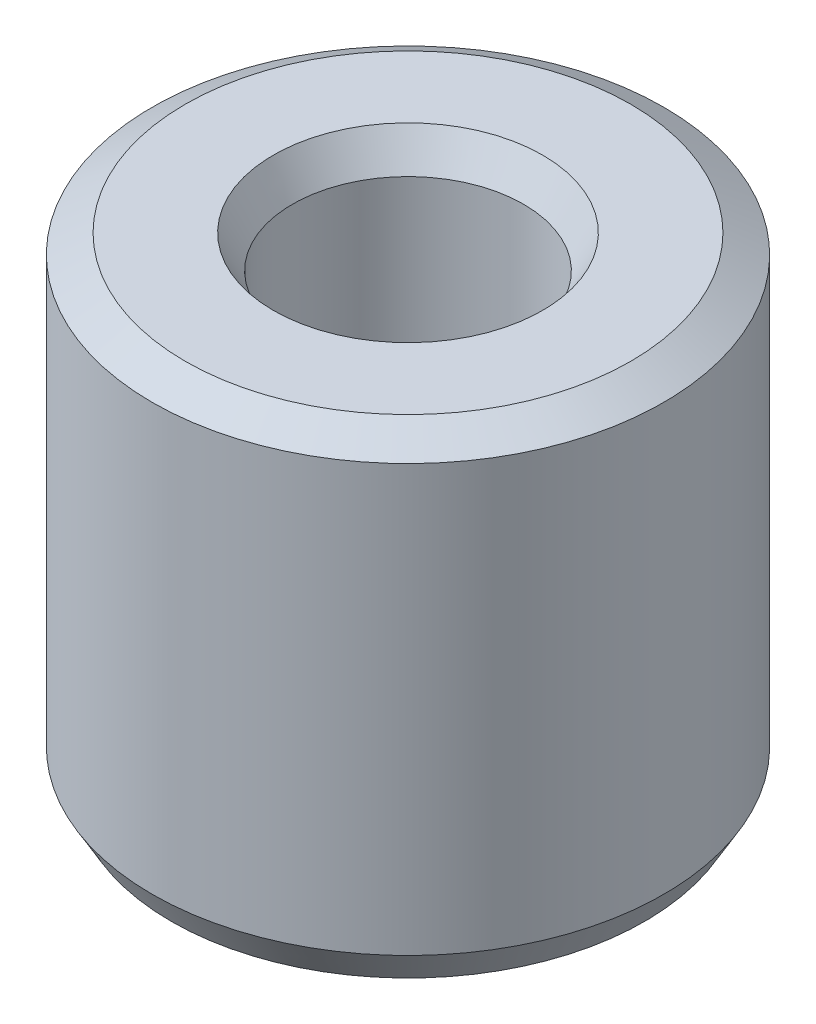
ISO-10303-21;
HEADER;
FILE_DESCRIPTION(('STEP AP214'),'2;1');
FILE_NAME('part.step','',(''),(''),'','','');
FILE_SCHEMA(('AUTOMOTIVE_DESIGN { 1 0 10303 214 1 1 1 1 }'));
ENDSEC;
DATA;
#1=APPLICATION_CONTEXT('core data for automotive mechanical design processes');
#2=APPLICATION_PROTOCOL_DEFINITION('international standard','automotive_design',2000,#1);
#3=PRODUCT_CONTEXT('',#1,'mechanical');
#4=PRODUCT('Part','Part','',(#3));
#5=PRODUCT_RELATED_PRODUCT_CATEGORY('part','',(#4));
#6=PRODUCT_DEFINITION_FORMATION('','',#4);
#7=PRODUCT_DEFINITION_CONTEXT('part definition',#1,'design');
#8=PRODUCT_DEFINITION('design','',#6,#7);
#9=PRODUCT_DEFINITION_SHAPE('','',#8);
#10=(LENGTH_UNIT() NAMED_UNIT(*) SI_UNIT(.MILLI.,.METRE.));
#11=(NAMED_UNIT(*) PLANE_ANGLE_UNIT() SI_UNIT($,.RADIAN.));
#12=(NAMED_UNIT(*) SI_UNIT($,.STERADIAN.) SOLID_ANGLE_UNIT());
#13=UNCERTAINTY_MEASURE_WITH_UNIT(LENGTH_MEASURE(1.E-05),#10,'distance_accuracy_value','');
#14=(GEOMETRIC_REPRESENTATION_CONTEXT(3) GLOBAL_UNCERTAINTY_ASSIGNED_CONTEXT((#13)) GLOBAL_UNIT_ASSIGNED_CONTEXT((#10,
#11,#12)) REPRESENTATION_CONTEXT('',''));
#15=CARTESIAN_POINT('',(0.,0.,0.));
#16=DIRECTION('',(0.,0.,1.));
#17=DIRECTION('',(1.,0.,0.));
#18=AXIS2_PLACEMENT_3D('',#15,#16,#17);
#19=CARTESIAN_POINT('',(0.,9.34786560931737,0.));
#20=DIRECTION('',(0.,-1.,0.));
#21=DIRECTION('',(0.,0.,-1.));
#22=AXIS2_PLACEMENT_3D('',#19,#20,#21);
#23=CYLINDRICAL_SURFACE('',#22,5.);
#24=CARTESIAN_POINT('',(0.,0.64557947320755,0.));
#25=DIRECTION('',(0.,1.,0.));
#26=DIRECTION('',(0.,0.,1.));
#27=AXIS2_PLACEMENT_3D('',#24,#25,#26);
#28=CIRCLE('',#27,5.);
#29=CARTESIAN_POINT('',(0.,0.64557947320755,5.));
#30=VERTEX_POINT('',#29);
#31=EDGE_CURVE('E10',#30,#30,#28,.T.);
#32=ORIENTED_EDGE('',*,*,#31,.T.);
#33=EDGE_LOOP('',(#32));
#34=FACE_BOUND('',#33,.T.);
#35=CARTESIAN_POINT('',(0.,8.97514012667769,0.));
#36=DIRECTION('',(0.,1.,0.));
#37=DIRECTION('',(0.,0.,1.));
#38=AXIS2_PLACEMENT_3D('',#35,#36,#37);
#39=CIRCLE('',#38,5.);
#40=CARTESIAN_POINT('',(0.,8.97514012667769,5.));
#41=VERTEX_POINT('',#40);
#42=EDGE_CURVE('E50',#41,#41,#39,.F.);
#43=ORIENTED_EDGE('',*,*,#42,.T.);
#44=EDGE_LOOP('',(#43));
#45=FACE_BOUND('',#44,.T.);
#46=ADVANCED_FACE('F39',(#34,#45),#23,.T.);
#47=CARTESIAN_POINT('',(0.,9.34786560931737,0.));
#48=DIRECTION('',(0.,1.,0.));
#49=DIRECTION('',(0.,0.,1.));
#50=AXIS2_PLACEMENT_3D('',#47,#48,#49);
#51=PLANE('',#50);
#52=CARTESIAN_POINT('',(0.,9.34786560931737,0.));
#53=DIRECTION('',(0.,1.,0.));
#54=DIRECTION('',(0.,0.,1.));
#55=AXIS2_PLACEMENT_3D('',#52,#53,#54);
#56=CIRCLE('',#55,2.63191980888608);
#57=CARTESIAN_POINT('',(0.,9.34786560931737,2.63191980888608));
#58=VERTEX_POINT('',#57);
#59=EDGE_CURVE('E58',#58,#58,#56,.F.);
#60=ORIENTED_EDGE('',*,*,#59,.T.);
#61=EDGE_LOOP('',(#60));
#62=FACE_BOUND('',#61,.T.);
#63=CARTESIAN_POINT('',(0.,9.34786560931737,0.));
#64=DIRECTION('',(0.,1.,0.));
#65=DIRECTION('',(0.,0.,1.));
#66=AXIS2_PLACEMENT_3D('',#63,#64,#65);
#67=CIRCLE('',#66,4.35442052679245);
#68=CARTESIAN_POINT('',(0.,9.34786560931737,4.35442052679245));
#69=VERTEX_POINT('',#68);
#70=EDGE_CURVE('E61',#69,#69,#67,.T.);
#71=ORIENTED_EDGE('',*,*,#70,.T.);
#72=EDGE_LOOP('',(#71));
#73=FACE_BOUND('',#72,.T.);
#74=ADVANCED_FACE('F88',(#62,#73),#51,.T.);
#75=CARTESIAN_POINT('',(0.,0.,0.));
#76=DIRECTION('',(0.,1.,0.));
#77=DIRECTION('',(0.,0.,1.));
#78=AXIS2_PLACEMENT_3D('',#75,#76,#77);
#79=PLANE('',#78);
#80=CARTESIAN_POINT('',(0.,0.,0.));
#81=DIRECTION('',(0.,1.,0.));
#82=DIRECTION('',(0.,0.,1.));
#83=AXIS2_PLACEMENT_3D('',#80,#81,#82);
#84=CIRCLE('',#83,2.90477379945395);
#85=CARTESIAN_POINT('',(0.,0.,2.90477379945395));
#86=VERTEX_POINT('',#85);
#87=EDGE_CURVE('E51',#86,#86,#84,.T.);
#88=ORIENTED_EDGE('',*,*,#87,.T.);
#89=EDGE_LOOP('',(#88));
#90=FACE_BOUND('',#89,.T.);
#91=CARTESIAN_POINT('',(0.,0.,0.));
#92=DIRECTION('',(0.,1.,0.));
#93=DIRECTION('',(0.,0.,1.));
#94=AXIS2_PLACEMENT_3D('',#91,#92,#93);
#95=CIRCLE('',#94,4.62727451736032);
#96=CARTESIAN_POINT('',(0.,0.,4.62727451736032));
#97=VERTEX_POINT('',#96);
#98=EDGE_CURVE('E54',#97,#97,#95,.F.);
#99=ORIENTED_EDGE('',*,*,#98,.T.);
#100=EDGE_LOOP('',(#99));
#101=FACE_BOUND('',#100,.T.);
#102=ADVANCED_FACE('F83',(#90,#101),#79,.F.);
#103=CARTESIAN_POINT('',(0.,9.34786560931737,0.));
#104=DIRECTION('',(0.,-1.,0.));
#105=DIRECTION('',(0.,0.,-1.));
#106=AXIS2_PLACEMENT_3D('',#103,#104,#105);
#107=CYLINDRICAL_SURFACE('',#106,2.2591943262464);
#108=CARTESIAN_POINT('',(0.,8.70228613610982,0.));
#109=DIRECTION('',(0.,1.,0.));
#110=DIRECTION('',(0.,0.,1.));
#111=AXIS2_PLACEMENT_3D('',#108,#109,#110);
#112=CIRCLE('',#111,2.2591943262464);
#113=CARTESIAN_POINT('',(0.,8.70228613610982,2.2591943262464));
#114=VERTEX_POINT('',#113);
#115=EDGE_CURVE('E67',#114,#114,#112,.T.);
#116=ORIENTED_EDGE('',*,*,#115,.T.);
#117=EDGE_LOOP('',(#116));
#118=FACE_BOUND('',#117,.T.);
#119=CARTESIAN_POINT('',(0.,0.372725482639683,0.));
#120=DIRECTION('',(0.,1.,0.));
#121=DIRECTION('',(0.,0.,1.));
#122=AXIS2_PLACEMENT_3D('',#119,#120,#121);
#123=CIRCLE('',#122,2.2591943262464);
#124=CARTESIAN_POINT('',(0.,0.372725482639683,2.2591943262464));
#125=VERTEX_POINT('',#124);
#126=EDGE_CURVE('E69',#125,#125,#123,.F.);
#127=ORIENTED_EDGE('',*,*,#126,.T.);
#128=EDGE_LOOP('',(#127));
#129=FACE_BOUND('',#128,.T.);
#130=ADVANCED_FACE('F71',(#118,#129),#107,.F.);
#131=CARTESIAN_POINT('',(0.,8.70228613610982,0.));
#132=DIRECTION('',(0.,1.,0.));
#133=DIRECTION('',(0.,0.,1.));
#134=AXIS2_PLACEMENT_3D('',#131,#132,#133);
#135=CONICAL_SURFACE('',#134,2.2591943262464,0.523598775598305);
#136=ORIENTED_EDGE('',*,*,#59,.F.);
#137=EDGE_LOOP('',(#136));
#138=FACE_BOUND('',#137,.T.);
#139=ORIENTED_EDGE('',*,*,#115,.F.);
#140=EDGE_LOOP('',(#139));
#141=FACE_BOUND('',#140,.T.);
#142=ADVANCED_FACE('F77',(#138,#141),#135,.F.);
#143=CARTESIAN_POINT('',(0.,0.,0.));
#144=DIRECTION('',(0.,-1.,0.));
#145=DIRECTION('',(0.,0.,-1.));
#146=AXIS2_PLACEMENT_3D('',#143,#144,#145);
#147=CONICAL_SURFACE('',#146,2.90477379945395,1.04719755119659);
#148=ORIENTED_EDGE('',*,*,#126,.F.);
#149=EDGE_LOOP('',(#148));
#150=FACE_BOUND('',#149,.T.);
#151=ORIENTED_EDGE('',*,*,#87,.F.);
#152=EDGE_LOOP('',(#151));
#153=FACE_BOUND('',#152,.T.);
#154=ADVANCED_FACE('F73',(#150,#153),#147,.F.);
#155=CARTESIAN_POINT('',(0.,0.64557947320755,0.));
#156=DIRECTION('',(0.,1.,0.));
#157=DIRECTION('',(0.,0.,1.));
#158=AXIS2_PLACEMENT_3D('',#155,#156,#157);
#159=CONICAL_SURFACE('',#158,5.,0.523598775598304);
#160=ORIENTED_EDGE('',*,*,#98,.F.);
#161=EDGE_LOOP('',(#160));
#162=FACE_BOUND('',#161,.T.);
#163=ORIENTED_EDGE('',*,*,#31,.F.);
#164=EDGE_LOOP('',(#163));
#165=FACE_BOUND('',#164,.T.);
#166=ADVANCED_FACE('F76',(#162,#165),#159,.T.);
#167=CARTESIAN_POINT('',(0.,9.34786560931737,0.));
#168=DIRECTION('',(0.,-1.,0.));
#169=DIRECTION('',(0.,0.,-1.));
#170=AXIS2_PLACEMENT_3D('',#167,#168,#169);
#171=CONICAL_SURFACE('',#170,4.35442052679245,1.04719755119659);
#172=ORIENTED_EDGE('',*,*,#42,.F.);
#173=EDGE_LOOP('',(#172));
#174=FACE_BOUND('',#173,.T.);
#175=ORIENTED_EDGE('',*,*,#70,.F.);
#176=EDGE_LOOP('',(#175));
#177=FACE_BOUND('',#176,.T.);
#178=ADVANCED_FACE('F45',(#174,#177),#171,.T.);
#179=CLOSED_SHELL('',(#46,#74,#102,#130,#142,#154,#166,#178));
#180=MANIFOLD_SOLID_BREP('B2',#179);
#181=ADVANCED_BREP_SHAPE_REPRESENTATION('',(#18,#180),#14);
#182=SHAPE_DEFINITION_REPRESENTATION(#9,#181);
ENDSEC;
END-ISO-10303-21;
